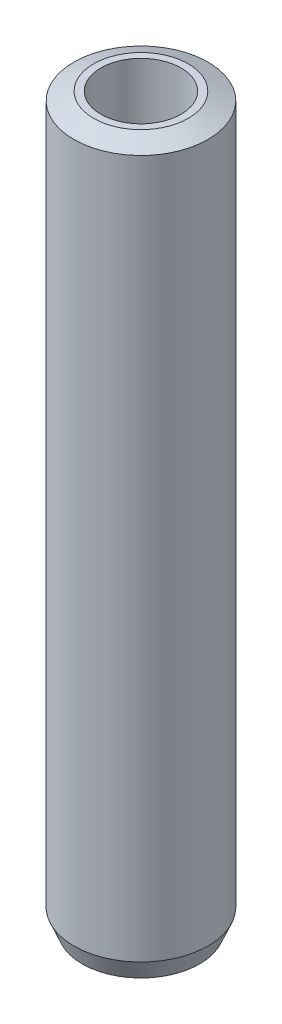
ISO-10303-21;
HEADER;
FILE_DESCRIPTION(('STEP AP214'),'2;1');
FILE_NAME('part.step','',(''),(''),'','','');
FILE_SCHEMA(('AUTOMOTIVE_DESIGN { 1 0 10303 214 1 1 1 1 }'));
ENDSEC;
DATA;
#1=APPLICATION_CONTEXT('core data for automotive mechanical design processes');
#2=APPLICATION_PROTOCOL_DEFINITION('international standard','automotive_design',2000,#1);
#3=PRODUCT_CONTEXT('',#1,'mechanical');
#4=PRODUCT('Part','Part','',(#3));
#5=PRODUCT_RELATED_PRODUCT_CATEGORY('part','',(#4));
#6=PRODUCT_DEFINITION_FORMATION('','',#4);
#7=PRODUCT_DEFINITION_CONTEXT('part definition',#1,'design');
#8=PRODUCT_DEFINITION('design','',#6,#7);
#9=PRODUCT_DEFINITION_SHAPE('','',#8);
#10=(LENGTH_UNIT() NAMED_UNIT(*) SI_UNIT(.MILLI.,.METRE.));
#11=(NAMED_UNIT(*) PLANE_ANGLE_UNIT() SI_UNIT($,.RADIAN.));
#12=(NAMED_UNIT(*) SI_UNIT($,.STERADIAN.) SOLID_ANGLE_UNIT());
#13=UNCERTAINTY_MEASURE_WITH_UNIT(LENGTH_MEASURE(1.E-05),#10,'distance_accuracy_value','');
#14=(GEOMETRIC_REPRESENTATION_CONTEXT(3) GLOBAL_UNCERTAINTY_ASSIGNED_CONTEXT((#13)) GLOBAL_UNIT_ASSIGNED_CONTEXT((#10,
#11,#12)) REPRESENTATION_CONTEXT('',''));
#15=CARTESIAN_POINT('',(0.,0.,0.));
#16=DIRECTION('',(0.,0.,1.));
#17=DIRECTION('',(1.,0.,0.));
#18=AXIS2_PLACEMENT_3D('',#15,#16,#17);
#19=CARTESIAN_POINT('',(0.,189.616163042472,0.));
#20=DIRECTION('',(0.,-1.,0.));
#21=DIRECTION('',(0.,0.,-1.));
#22=AXIS2_PLACEMENT_3D('',#19,#20,#21);
#23=CYLINDRICAL_SURFACE('',#22,17.5);
#24=CARTESIAN_POINT('',(0.,187.4336798925,0.));
#25=DIRECTION('',(0.,1.,0.));
#26=DIRECTION('',(0.,0.,1.));
#27=AXIS2_PLACEMENT_3D('',#24,#25,#26);
#28=CIRCLE('',#27,17.5);
#29=CARTESIAN_POINT('',(0.,187.4336798925,17.5));
#30=VERTEX_POINT('',#29);
#31=EDGE_CURVE('E50',#30,#30,#28,.F.);
#32=ORIENTED_EDGE('',*,*,#31,.T.);
#33=EDGE_LOOP('',(#32));
#34=FACE_BOUND('',#33,.T.);
#35=CARTESIAN_POINT('',(0.,5.1614634018663,0.));
#36=DIRECTION('',(0.,1.,0.));
#37=DIRECTION('',(0.,0.,1.));
#38=AXIS2_PLACEMENT_3D('',#35,#36,#37);
#39=CIRCLE('',#38,17.5);
#40=CARTESIAN_POINT('',(0.,5.1614634018663,17.5));
#41=VERTEX_POINT('',#40);
#42=EDGE_CURVE('E51',#41,#41,#39,.T.);
#43=ORIENTED_EDGE('',*,*,#42,.T.);
#44=EDGE_LOOP('',(#43));
#45=FACE_BOUND('',#44,.T.);
#46=ADVANCED_FACE('F39',(#34,#45),#23,.T.);
#47=CARTESIAN_POINT('',(0.,189.616163042472,0.));
#48=DIRECTION('',(0.,1.,0.));
#49=DIRECTION('',(0.,0.,1.));
#50=AXIS2_PLACEMENT_3D('',#47,#48,#49);
#51=PLANE('',#50);
#52=CARTESIAN_POINT('',(0.,189.616163042472,0.));
#53=DIRECTION('',(0.,1.,0.));
#54=DIRECTION('',(0.,0.,1.));
#55=AXIS2_PLACEMENT_3D('',#52,#53,#54);
#56=CIRCLE('',#55,12.3385365981338);
#57=CARTESIAN_POINT('',(0.,189.616163042472,12.3385365981338));
#58=VERTEX_POINT('',#57);
#59=EDGE_CURVE('E54',#58,#58,#56,.T.);
#60=ORIENTED_EDGE('',*,*,#59,.T.);
#61=EDGE_LOOP('',(#60));
#62=FACE_BOUND('',#61,.T.);
#63=CARTESIAN_POINT('',(0.,189.616163042472,0.));
#64=DIRECTION('',(0.,1.,0.));
#65=DIRECTION('',(0.,0.,1.));
#66=AXIS2_PLACEMENT_3D('',#63,#64,#65);
#67=CIRCLE('',#66,10.4717361801295);
#68=CARTESIAN_POINT('',(0.,189.616163042472,10.4717361801295));
#69=VERTEX_POINT('',#68);
#70=EDGE_CURVE('E58',#69,#69,#67,.T.);
#71=ORIENTED_EDGE('',*,*,#70,.F.);
#72=EDGE_LOOP('',(#71));
#73=FACE_BOUND('',#72,.T.);
#74=ADVANCED_FACE('F69',(#62,#73),#51,.T.);
#75=CARTESIAN_POINT('',(0.,0.,0.));
#76=DIRECTION('',(0.,1.,0.));
#77=DIRECTION('',(0.,0.,1.));
#78=AXIS2_PLACEMENT_3D('',#75,#76,#77);
#79=PLANE('',#78);
#80=CARTESIAN_POINT('',(0.,0.,0.));
#81=DIRECTION('',(0.,1.,0.));
#82=DIRECTION('',(0.,0.,1.));
#83=AXIS2_PLACEMENT_3D('',#80,#81,#82);
#84=CIRCLE('',#83,15.3175168500279);
#85=CARTESIAN_POINT('',(0.,0.,15.3175168500279));
#86=VERTEX_POINT('',#85);
#87=EDGE_CURVE('E10',#86,#86,#84,.F.);
#88=ORIENTED_EDGE('',*,*,#87,.T.);
#89=EDGE_LOOP('',(#88));
#90=FACE_BOUND('',#89,.T.);
#91=CARTESIAN_POINT('',(0.,0.,0.));
#92=DIRECTION('',(0.,1.,0.));
#93=DIRECTION('',(0.,0.,1.));
#94=AXIS2_PLACEMENT_3D('',#91,#92,#93);
#95=CIRCLE('',#94,10.4717361801295);
#96=CARTESIAN_POINT('',(0.,0.,10.4717361801295));
#97=VERTEX_POINT('',#96);
#98=EDGE_CURVE('E63',#97,#97,#95,.T.);
#99=ORIENTED_EDGE('',*,*,#98,.T.);
#100=EDGE_LOOP('',(#99));
#101=FACE_BOUND('',#100,.T.);
#102=ADVANCED_FACE('F75',(#90,#101),#79,.F.);
#103=CARTESIAN_POINT('',(0.,189.616163042472,0.));
#104=DIRECTION('',(0.,-1.,0.));
#105=DIRECTION('',(0.,0.,-1.));
#106=AXIS2_PLACEMENT_3D('',#103,#104,#105);
#107=CYLINDRICAL_SURFACE('',#106,10.4717361801295);
#108=ORIENTED_EDGE('',*,*,#70,.T.);
#109=EDGE_LOOP('',(#108));
#110=FACE_BOUND('',#109,.T.);
#111=ORIENTED_EDGE('',*,*,#98,.F.);
#112=EDGE_LOOP('',(#111));
#113=FACE_BOUND('',#112,.T.);
#114=ADVANCED_FACE('F70',(#110,#113),#107,.F.);
#115=CARTESIAN_POINT('',(0.,189.616163042472,0.));
#116=DIRECTION('',(0.,-1.,0.));
#117=DIRECTION('',(0.,0.,-1.));
#118=AXIS2_PLACEMENT_3D('',#115,#116,#117);
#119=CONICAL_SURFACE('',#118,12.3385365981338,1.17075500257884);
#120=ORIENTED_EDGE('',*,*,#31,.F.);
#121=EDGE_LOOP('',(#120));
#122=FACE_BOUND('',#121,.T.);
#123=ORIENTED_EDGE('',*,*,#59,.F.);
#124=EDGE_LOOP('',(#123));
#125=FACE_BOUND('',#124,.T.);
#126=ADVANCED_FACE('F81',(#122,#125),#119,.T.);
#127=CARTESIAN_POINT('',(0.,5.1614634018663,0.));
#128=DIRECTION('',(0.,1.,0.));
#129=DIRECTION('',(0.,0.,1.));
#130=AXIS2_PLACEMENT_3D('',#127,#128,#129);
#131=CONICAL_SURFACE('',#130,17.5,0.400041324216056);
#132=ORIENTED_EDGE('',*,*,#87,.F.);
#133=EDGE_LOOP('',(#132));
#134=FACE_BOUND('',#133,.T.);
#135=ORIENTED_EDGE('',*,*,#42,.F.);
#136=EDGE_LOOP('',(#135));
#137=FACE_BOUND('',#136,.T.);
#138=ADVANCED_FACE('F45',(#134,#137),#131,.T.);
#139=CLOSED_SHELL('',(#46,#74,#102,#114,#126,#138));
#140=MANIFOLD_SOLID_BREP('B2',#139);
#141=ADVANCED_BREP_SHAPE_REPRESENTATION('',(#18,#140),#14);
#142=SHAPE_DEFINITION_REPRESENTATION(#9,#141);
ENDSEC;
END-ISO-10303-21;
